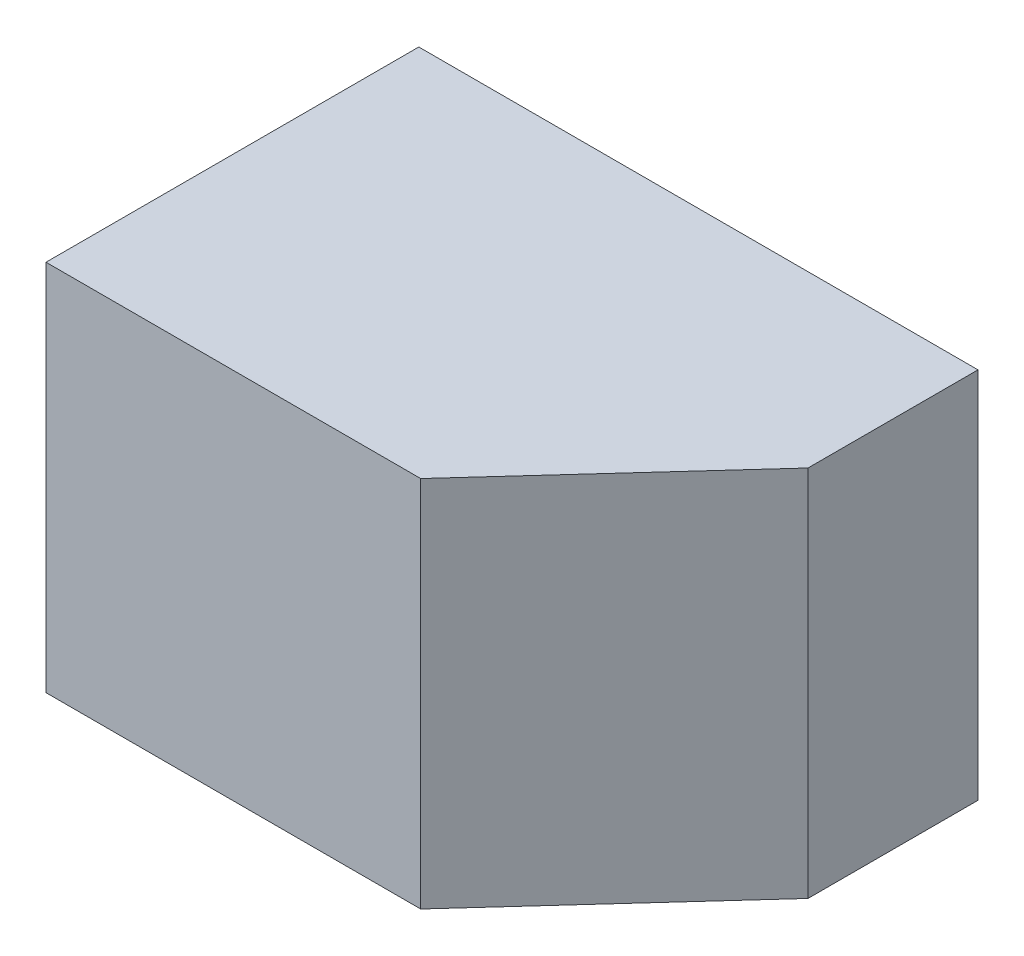
ISO-10303-21;
HEADER;
FILE_DESCRIPTION(('STEP AP214'),'2;1');
FILE_NAME('part.step','',(''),(''),'','','');
FILE_SCHEMA(('AUTOMOTIVE_DESIGN { 1 0 10303 214 1 1 1 1 }'));
ENDSEC;
DATA;
#1=APPLICATION_CONTEXT('core data for automotive mechanical design processes');
#2=APPLICATION_PROTOCOL_DEFINITION('international standard','automotive_design',2000,#1);
#3=PRODUCT_CONTEXT('',#1,'mechanical');
#4=PRODUCT('Part','Part','',(#3));
#5=PRODUCT_RELATED_PRODUCT_CATEGORY('part','',(#4));
#6=PRODUCT_DEFINITION_FORMATION('','',#4);
#7=PRODUCT_DEFINITION_CONTEXT('part definition',#1,'design');
#8=PRODUCT_DEFINITION('design','',#6,#7);
#9=PRODUCT_DEFINITION_SHAPE('','',#8);
#10=(LENGTH_UNIT() NAMED_UNIT(*) SI_UNIT(.MILLI.,.METRE.));
#11=(NAMED_UNIT(*) PLANE_ANGLE_UNIT() SI_UNIT($,.RADIAN.));
#12=(NAMED_UNIT(*) SI_UNIT($,.STERADIAN.) SOLID_ANGLE_UNIT());
#13=UNCERTAINTY_MEASURE_WITH_UNIT(LENGTH_MEASURE(1.E-05),#10,'distance_accuracy_value','');
#14=(GEOMETRIC_REPRESENTATION_CONTEXT(3) GLOBAL_UNCERTAINTY_ASSIGNED_CONTEXT((#13)) GLOBAL_UNIT_ASSIGNED_CONTEXT((#10,
#11,#12)) REPRESENTATION_CONTEXT('',''));
#15=CARTESIAN_POINT('',(0.,0.,0.));
#16=DIRECTION('',(0.,0.,1.));
#17=DIRECTION('',(1.,0.,0.));
#18=AXIS2_PLACEMENT_3D('',#15,#16,#17);
#19=CARTESIAN_POINT('',(15.,0.,0.));
#20=DIRECTION('',(0.,0.,-1.));
#21=DIRECTION('',(-1.,0.,0.));
#22=AXIS2_PLACEMENT_3D('',#19,#20,#21);
#23=PLANE('',#22);
#24=DIRECTION('',(-1.,0.,0.));
#25=VECTOR('',#24,1.);
#26=CARTESIAN_POINT('',(15.,0.,0.));
#27=LINE('',#26,#25);
#28=CARTESIAN_POINT('',(10.0504865385288,0.,0.));
#29=VERTEX_POINT('',#28);
#30=CARTESIAN_POINT('',(0.,0.,0.));
#31=VERTEX_POINT('',#30);
#32=EDGE_CURVE('E47',#29,#31,#27,.T.);
#33=ORIENTED_EDGE('',*,*,#32,.F.);
#34=DIRECTION('',(0.,1.,0.));
#35=VECTOR('',#34,1.);
#36=CARTESIAN_POINT('',(10.0504865385288,-5.,0.));
#37=LINE('',#36,#35);
#38=CARTESIAN_POINT('',(10.0504865385288,10.,0.));
#39=VERTEX_POINT('',#38);
#40=EDGE_CURVE('E88',#29,#39,#37,.T.);
#41=ORIENTED_EDGE('',*,*,#40,.T.);
#42=DIRECTION('',(-1.,0.,0.));
#43=VECTOR('',#42,1.);
#44=CARTESIAN_POINT('',(15.,10.,0.));
#45=LINE('',#44,#43);
#46=CARTESIAN_POINT('',(0.,10.,0.));
#47=VERTEX_POINT('',#46);
#48=EDGE_CURVE('E82',#39,#47,#45,.T.);
#49=ORIENTED_EDGE('',*,*,#48,.T.);
#50=DIRECTION('',(0.,-1.,0.));
#51=VECTOR('',#50,1.);
#52=CARTESIAN_POINT('',(0.,0.,0.));
#53=LINE('',#52,#51);
#54=EDGE_CURVE('E86',#47,#31,#53,.T.);
#55=ORIENTED_EDGE('',*,*,#54,.T.);
#56=EDGE_LOOP('',(#33,#41,#49,#55));
#57=FACE_BOUND('',#56,.T.);
#58=ADVANCED_FACE('F39',(#57),#23,.F.);
#59=CARTESIAN_POINT('',(15.,0.,0.));
#60=DIRECTION('',(0.,1.,0.));
#61=DIRECTION('',(0.,0.,1.));
#62=AXIS2_PLACEMENT_3D('',#59,#60,#61);
#63=PLANE('',#62);
#64=DIRECTION('',(0.,0.,-1.));
#65=VECTOR('',#64,1.);
#66=CARTESIAN_POINT('',(15.,0.,0.));
#67=LINE('',#66,#65);
#68=CARTESIAN_POINT('',(15.,0.,-5.44012820797624));
#69=VERTEX_POINT('',#68);
#70=CARTESIAN_POINT('',(15.,0.,-10.));
#71=VERTEX_POINT('',#70);
#72=EDGE_CURVE('E103',#69,#71,#67,.T.);
#73=ORIENTED_EDGE('',*,*,#72,.F.);
#74=DIRECTION('',(-0.67296622242895,0.,0.73967321397338));
#75=VECTOR('',#74,1.);
#76=CARTESIAN_POINT('',(12.2920396990641,0.,-2.46374450200647));
#77=LINE('',#76,#75);
#78=EDGE_CURVE('E54',#69,#29,#77,.T.);
#79=ORIENTED_EDGE('',*,*,#78,.T.);
#80=ORIENTED_EDGE('',*,*,#32,.T.);
#81=DIRECTION('',(0.,0.,-1.));
#82=VECTOR('',#81,1.);
#83=CARTESIAN_POINT('',(0.,0.,0.));
#84=LINE('',#83,#82);
#85=CARTESIAN_POINT('',(0.,0.,-10.));
#86=VERTEX_POINT('',#85);
#87=EDGE_CURVE('E108',#31,#86,#84,.T.);
#88=ORIENTED_EDGE('',*,*,#87,.T.);
#89=DIRECTION('',(-1.,0.,0.));
#90=VECTOR('',#89,1.);
#91=CARTESIAN_POINT('',(15.,0.,-10.));
#92=LINE('',#91,#90);
#93=EDGE_CURVE('E122',#71,#86,#92,.T.);
#94=ORIENTED_EDGE('',*,*,#93,.F.);
#95=EDGE_LOOP('',(#73,#79,#80,#88,#94));
#96=FACE_BOUND('',#95,.T.);
#97=ADVANCED_FACE('F128',(#96),#63,.F.);
#98=CARTESIAN_POINT('',(15.,0.,-10.));
#99=DIRECTION('',(0.,0.,1.));
#100=DIRECTION('',(1.,0.,0.));
#101=AXIS2_PLACEMENT_3D('',#98,#99,#100);
#102=PLANE('',#101);
#103=DIRECTION('',(0.,1.,0.));
#104=VECTOR('',#103,1.);
#105=CARTESIAN_POINT('',(0.,0.,-10.));
#106=LINE('',#105,#104);
#107=CARTESIAN_POINT('',(0.,10.,-10.));
#108=VERTEX_POINT('',#107);
#109=EDGE_CURVE('E104',#86,#108,#106,.T.);
#110=ORIENTED_EDGE('',*,*,#109,.T.);
#111=DIRECTION('',(-1.,0.,0.));
#112=VECTOR('',#111,1.);
#113=CARTESIAN_POINT('',(15.,10.,-10.));
#114=LINE('',#113,#112);
#115=CARTESIAN_POINT('',(15.,10.,-10.));
#116=VERTEX_POINT('',#115);
#117=EDGE_CURVE('E92',#116,#108,#114,.T.);
#118=ORIENTED_EDGE('',*,*,#117,.F.);
#119=DIRECTION('',(0.,1.,0.));
#120=VECTOR('',#119,1.);
#121=CARTESIAN_POINT('',(15.,0.,-10.));
#122=LINE('',#121,#120);
#123=EDGE_CURVE('E62',#71,#116,#122,.T.);
#124=ORIENTED_EDGE('',*,*,#123,.F.);
#125=ORIENTED_EDGE('',*,*,#93,.T.);
#126=EDGE_LOOP('',(#110,#118,#124,#125));
#127=FACE_BOUND('',#126,.T.);
#128=ADVANCED_FACE('F146',(#127),#102,.F.);
#129=CARTESIAN_POINT('',(15.,10.,0.));
#130=DIRECTION('',(0.,-1.,0.));
#131=DIRECTION('',(0.,0.,-1.));
#132=AXIS2_PLACEMENT_3D('',#129,#130,#131);
#133=PLANE('',#132);
#134=ORIENTED_EDGE('',*,*,#48,.F.);
#135=DIRECTION('',(-0.67296622242895,0.,0.73967321397338));
#136=VECTOR('',#135,1.);
#137=CARTESIAN_POINT('',(10.0504865385288,10.,0.));
#138=LINE('',#137,#136);
#139=CARTESIAN_POINT('',(15.,10.,-5.44012820797624));
#140=VERTEX_POINT('',#139);
#141=EDGE_CURVE('E135',#140,#39,#138,.T.);
#142=ORIENTED_EDGE('',*,*,#141,.F.);
#143=DIRECTION('',(0.,0.,1.));
#144=VECTOR('',#143,1.);
#145=CARTESIAN_POINT('',(15.,10.,0.));
#146=LINE('',#145,#144);
#147=EDGE_CURVE('E93',#116,#140,#146,.T.);
#148=ORIENTED_EDGE('',*,*,#147,.F.);
#149=ORIENTED_EDGE('',*,*,#117,.T.);
#150=DIRECTION('',(0.,0.,1.));
#151=VECTOR('',#150,1.);
#152=CARTESIAN_POINT('',(0.,10.,0.));
#153=LINE('',#152,#151);
#154=EDGE_CURVE('E97',#108,#47,#153,.T.);
#155=ORIENTED_EDGE('',*,*,#154,.T.);
#156=EDGE_LOOP('',(#134,#142,#148,#149,#155));
#157=FACE_BOUND('',#156,.T.);
#158=ADVANCED_FACE('F98',(#157),#133,.F.);
#159=CARTESIAN_POINT('',(15.,0.,0.));
#160=DIRECTION('',(-1.,0.,0.));
#161=DIRECTION('',(0.,0.,1.));
#162=AXIS2_PLACEMENT_3D('',#159,#160,#161);
#163=PLANE('',#162);
#164=ORIENTED_EDGE('',*,*,#147,.T.);
#165=DIRECTION('',(0.,-1.,0.));
#166=VECTOR('',#165,1.);
#167=CARTESIAN_POINT('',(15.,0.,-5.44012820797624));
#168=LINE('',#167,#166);
#169=EDGE_CURVE('E11',#140,#69,#168,.T.);
#170=ORIENTED_EDGE('',*,*,#169,.T.);
#171=ORIENTED_EDGE('',*,*,#72,.T.);
#172=ORIENTED_EDGE('',*,*,#123,.T.);
#173=EDGE_LOOP('',(#164,#170,#171,#172));
#174=FACE_BOUND('',#173,.T.);
#175=ADVANCED_FACE('F138',(#174),#163,.F.);
#176=CARTESIAN_POINT('',(0.,0.,0.));
#177=DIRECTION('',(-1.,0.,0.));
#178=DIRECTION('',(0.,0.,1.));
#179=AXIS2_PLACEMENT_3D('',#176,#177,#178);
#180=PLANE('',#179);
#181=ORIENTED_EDGE('',*,*,#54,.F.);
#182=ORIENTED_EDGE('',*,*,#154,.F.);
#183=ORIENTED_EDGE('',*,*,#109,.F.);
#184=ORIENTED_EDGE('',*,*,#87,.F.);
#185=EDGE_LOOP('',(#181,#182,#183,#184));
#186=FACE_BOUND('',#185,.T.);
#187=ADVANCED_FACE('F107',(#186),#180,.T.);
#188=CARTESIAN_POINT('',(10.0504865385288,-5.,0.));
#189=DIRECTION('',(-0.73967321397338,0.,-0.67296622242895));
#190=DIRECTION('',(-0.67296622242895,0.,0.73967321397338));
#191=AXIS2_PLACEMENT_3D('',#188,#189,#190);
#192=PLANE('',#191);
#193=ORIENTED_EDGE('',*,*,#169,.F.);
#194=ORIENTED_EDGE('',*,*,#141,.T.);
#195=ORIENTED_EDGE('',*,*,#40,.F.);
#196=ORIENTED_EDGE('',*,*,#78,.F.);
#197=EDGE_LOOP('',(#193,#194,#195,#196));
#198=FACE_BOUND('',#197,.T.);
#199=ADVANCED_FACE('F134',(#198),#192,.F.);
#200=CLOSED_SHELL('',(#58,#97,#128,#158,#175,#187,#199));
#201=MANIFOLD_SOLID_BREP('B2',#200);
#202=ADVANCED_BREP_SHAPE_REPRESENTATION('',(#18,#201),#14);
#203=SHAPE_DEFINITION_REPRESENTATION(#9,#202);
ENDSEC;
END-ISO-10303-21;
